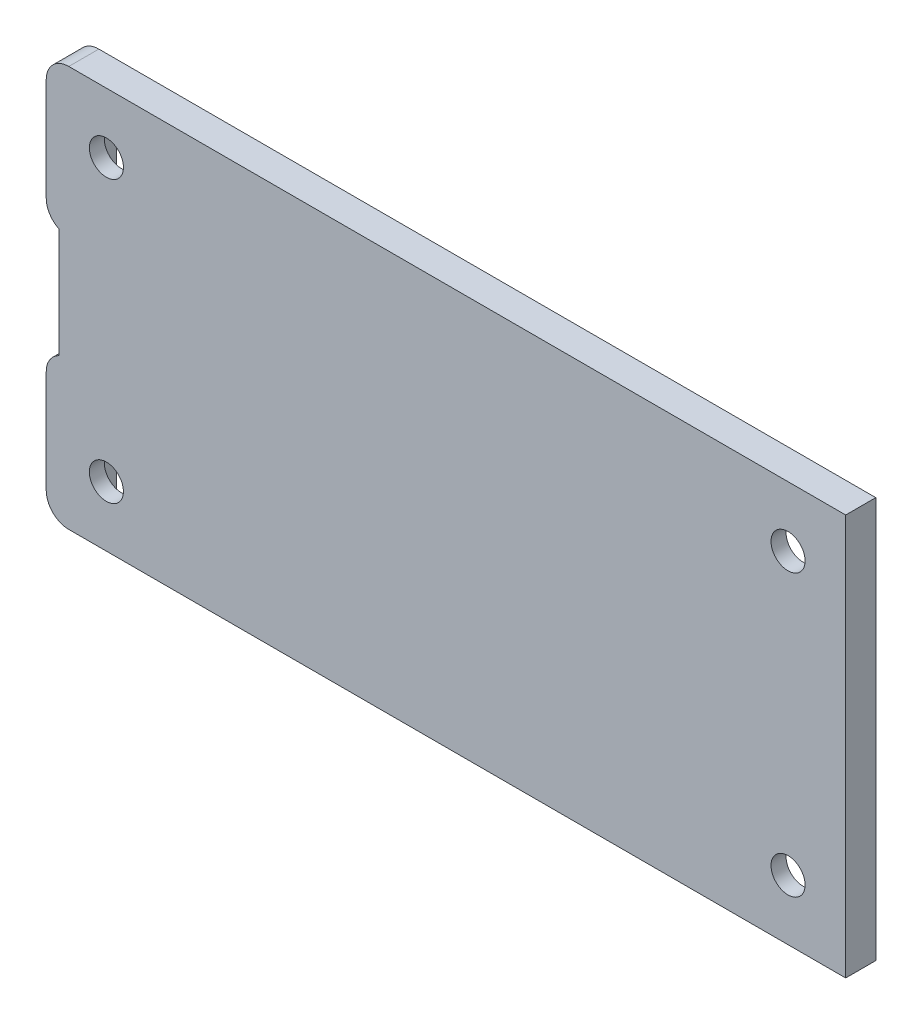
ISO-10303-21;
HEADER;
FILE_DESCRIPTION(('STEP AP214'),'2;1');
FILE_NAME('part.step','',(''),(''),'','','');
FILE_SCHEMA(('AUTOMOTIVE_DESIGN { 1 0 10303 214 1 1 1 1 }'));
ENDSEC;
DATA;
#1=APPLICATION_CONTEXT('core data for automotive mechanical design processes');
#2=APPLICATION_PROTOCOL_DEFINITION('international standard','automotive_design',2000,#1);
#3=PRODUCT_CONTEXT('',#1,'mechanical');
#4=PRODUCT('Part','Part','',(#3));
#5=PRODUCT_RELATED_PRODUCT_CATEGORY('part','',(#4));
#6=PRODUCT_DEFINITION_FORMATION('','',#4);
#7=PRODUCT_DEFINITION_CONTEXT('part definition',#1,'design');
#8=PRODUCT_DEFINITION('design','',#6,#7);
#9=PRODUCT_DEFINITION_SHAPE('','',#8);
#10=(LENGTH_UNIT() NAMED_UNIT(*) SI_UNIT(.MILLI.,.METRE.));
#11=(NAMED_UNIT(*) PLANE_ANGLE_UNIT() SI_UNIT($,.RADIAN.));
#12=(NAMED_UNIT(*) SI_UNIT($,.STERADIAN.) SOLID_ANGLE_UNIT());
#13=UNCERTAINTY_MEASURE_WITH_UNIT(LENGTH_MEASURE(1.E-05),#10,'distance_accuracy_value','');
#14=(GEOMETRIC_REPRESENTATION_CONTEXT(3) GLOBAL_UNCERTAINTY_ASSIGNED_CONTEXT((#13)) GLOBAL_UNIT_ASSIGNED_CONTEXT((#10,
#11,#12)) REPRESENTATION_CONTEXT('',''));
#15=CARTESIAN_POINT('',(0.,0.,0.));
#16=DIRECTION('',(0.,0.,1.));
#17=DIRECTION('',(1.,0.,0.));
#18=AXIS2_PLACEMENT_3D('',#15,#16,#17);
#19=CARTESIAN_POINT('',(0.,0.,3.));
#20=DIRECTION('',(1.,0.,0.));
#21=DIRECTION('',(0.,0.,-1.));
#22=AXIS2_PLACEMENT_3D('',#19,#20,#21);
#23=PLANE('',#22);
#24=DIRECTION('',(0.,-1.,0.));
#25=VECTOR('',#24,1.);
#26=CARTESIAN_POINT('',(0.,0.,3.));
#27=LINE('',#26,#25);
#28=CARTESIAN_POINT('',(0.,37.75,3.));
#29=VERTEX_POINT('',#28);
#30=CARTESIAN_POINT('',(0.,27.5,3.));
#31=VERTEX_POINT('',#30);
#32=EDGE_CURVE('E231',#29,#31,#27,.T.);
#33=ORIENTED_EDGE('',*,*,#32,.F.);
#34=DIRECTION('',(0.,0.,-1.));
#35=VECTOR('',#34,1.);
#36=CARTESIAN_POINT('',(0.,37.75,3.));
#37=LINE('',#36,#35);
#38=CARTESIAN_POINT('',(0.,37.75,0.));
#39=VERTEX_POINT('',#38);
#40=EDGE_CURVE('E286',#29,#39,#37,.T.);
#41=ORIENTED_EDGE('',*,*,#40,.T.);
#42=DIRECTION('',(0.,-1.,0.));
#43=VECTOR('',#42,1.);
#44=CARTESIAN_POINT('',(0.,0.,0.));
#45=LINE('',#44,#43);
#46=CARTESIAN_POINT('',(0.,27.5,0.));
#47=VERTEX_POINT('',#46);
#48=EDGE_CURVE('E241',#39,#47,#45,.T.);
#49=ORIENTED_EDGE('',*,*,#48,.T.);
#50=DIRECTION('',(0.,0.,1.));
#51=VECTOR('',#50,1.);
#52=CARTESIAN_POINT('',(0.,27.5,3.));
#53=LINE('',#52,#51);
#54=EDGE_CURVE('E271',#47,#31,#53,.T.);
#55=ORIENTED_EDGE('',*,*,#54,.T.);
#56=EDGE_LOOP('',(#33,#41,#49,#55));
#57=FACE_BOUND('',#56,.T.);
#58=ADVANCED_FACE('F36',(#57),#23,.F.);
#59=CARTESIAN_POINT('',(0.,12.5,0.));
#60=VERTEX_POINT('',#59);
#61=CARTESIAN_POINT('',(0.,2.25,0.));
#62=VERTEX_POINT('',#61);
#63=EDGE_CURVE('E230',#60,#62,#45,.T.);
#64=ORIENTED_EDGE('',*,*,#63,.T.);
#65=DIRECTION('',(0.,0.,-1.));
#66=VECTOR('',#65,1.);
#67=CARTESIAN_POINT('',(0.,2.25,3.));
#68=LINE('',#67,#66);
#69=CARTESIAN_POINT('',(0.,2.25,3.));
#70=VERTEX_POINT('',#69);
#71=EDGE_CURVE('E281',#62,#70,#68,.F.);
#72=ORIENTED_EDGE('',*,*,#71,.T.);
#73=CARTESIAN_POINT('',(0.,12.5,3.));
#74=VERTEX_POINT('',#73);
#75=EDGE_CURVE('E234',#74,#70,#27,.T.);
#76=ORIENTED_EDGE('',*,*,#75,.F.);
#77=DIRECTION('',(0.,0.,1.));
#78=VECTOR('',#77,1.);
#79=CARTESIAN_POINT('',(0.,12.5,3.));
#80=LINE('',#79,#78);
#81=EDGE_CURVE('E261',#74,#60,#80,.F.);
#82=ORIENTED_EDGE('',*,*,#81,.T.);
#83=EDGE_LOOP('',(#64,#72,#76,#82));
#84=FACE_BOUND('',#83,.T.);
#85=ADVANCED_FACE('F328',(#84),#23,.F.);
#86=CARTESIAN_POINT('',(0.,0.,3.));
#87=DIRECTION('',(0.,1.,0.));
#88=DIRECTION('',(0.,0.,1.));
#89=AXIS2_PLACEMENT_3D('',#86,#87,#88);
#90=PLANE('',#89);
#91=DIRECTION('',(1.,0.,0.));
#92=VECTOR('',#91,1.);
#93=CARTESIAN_POINT('',(0.,0.,3.));
#94=LINE('',#93,#92);
#95=CARTESIAN_POINT('',(2.25,0.,3.));
#96=VERTEX_POINT('',#95);
#97=CARTESIAN_POINT('',(79.75,0.,3.));
#98=VERTEX_POINT('',#97);
#99=EDGE_CURVE('E233',#96,#98,#94,.T.);
#100=ORIENTED_EDGE('',*,*,#99,.F.);
#101=DIRECTION('',(0.,0.,-1.));
#102=VECTOR('',#101,1.);
#103=CARTESIAN_POINT('',(2.25,0.,3.));
#104=LINE('',#103,#102);
#105=CARTESIAN_POINT('',(2.25,0.,0.));
#106=VERTEX_POINT('',#105);
#107=EDGE_CURVE('E274',#96,#106,#104,.T.);
#108=ORIENTED_EDGE('',*,*,#107,.T.);
#109=DIRECTION('',(1.,0.,0.));
#110=VECTOR('',#109,1.);
#111=CARTESIAN_POINT('',(0.,0.,0.));
#112=LINE('',#111,#110);
#113=CARTESIAN_POINT('',(79.75,0.,0.));
#114=VERTEX_POINT('',#113);
#115=EDGE_CURVE('E244',#106,#114,#112,.T.);
#116=ORIENTED_EDGE('',*,*,#115,.T.);
#117=DIRECTION('',(0.,0.,-1.));
#118=VECTOR('',#117,1.);
#119=CARTESIAN_POINT('',(79.75,0.,3.));
#120=LINE('',#119,#118);
#121=EDGE_CURVE('E253',#98,#114,#120,.T.);
#122=ORIENTED_EDGE('',*,*,#121,.F.);
#123=EDGE_LOOP('',(#100,#108,#116,#122));
#124=FACE_BOUND('',#123,.T.);
#125=ADVANCED_FACE('F340',(#124),#90,.F.);
#126=CARTESIAN_POINT('',(79.75,0.,3.));
#127=DIRECTION('',(-1.,0.,0.));
#128=DIRECTION('',(0.,-1.,0.));
#129=AXIS2_PLACEMENT_3D('',#126,#127,#128);
#130=PLANE('',#129);
#131=DIRECTION('',(0.,1.,0.));
#132=VECTOR('',#131,1.);
#133=CARTESIAN_POINT('',(79.75,0.,0.));
#134=LINE('',#133,#132);
#135=CARTESIAN_POINT('',(79.75,40.,0.));
#136=VERTEX_POINT('',#135);
#137=EDGE_CURVE('E246',#114,#136,#134,.T.);
#138=ORIENTED_EDGE('',*,*,#137,.T.);
#139=DIRECTION('',(0.,0.,-1.));
#140=VECTOR('',#139,1.);
#141=CARTESIAN_POINT('',(79.75,40.,3.));
#142=LINE('',#141,#140);
#143=CARTESIAN_POINT('',(79.75,40.,3.));
#144=VERTEX_POINT('',#143);
#145=EDGE_CURVE('E240',#144,#136,#142,.T.);
#146=ORIENTED_EDGE('',*,*,#145,.F.);
#147=DIRECTION('',(0.,1.,0.));
#148=VECTOR('',#147,1.);
#149=CARTESIAN_POINT('',(79.75,0.,3.));
#150=LINE('',#149,#148);
#151=EDGE_CURVE('E236',#98,#144,#150,.T.);
#152=ORIENTED_EDGE('',*,*,#151,.F.);
#153=ORIENTED_EDGE('',*,*,#121,.T.);
#154=EDGE_LOOP('',(#138,#146,#152,#153));
#155=FACE_BOUND('',#154,.T.);
#156=ADVANCED_FACE('F346',(#155),#130,.F.);
#157=CARTESIAN_POINT('',(0.,40.,3.));
#158=DIRECTION('',(0.,-1.,0.));
#159=DIRECTION('',(0.,0.,-1.));
#160=AXIS2_PLACEMENT_3D('',#157,#158,#159);
#161=PLANE('',#160);
#162=DIRECTION('',(-1.,0.,0.));
#163=VECTOR('',#162,1.);
#164=CARTESIAN_POINT('',(0.,40.,0.));
#165=LINE('',#164,#163);
#166=CARTESIAN_POINT('',(2.25,40.,0.));
#167=VERTEX_POINT('',#166);
#168=EDGE_CURVE('E248',#136,#167,#165,.T.);
#169=ORIENTED_EDGE('',*,*,#168,.T.);
#170=DIRECTION('',(0.,0.,-1.));
#171=VECTOR('',#170,1.);
#172=CARTESIAN_POINT('',(2.25,40.,3.));
#173=LINE('',#172,#171);
#174=CARTESIAN_POINT('',(2.25,40.,3.));
#175=VERTEX_POINT('',#174);
#176=EDGE_CURVE('E45',#167,#175,#173,.F.);
#177=ORIENTED_EDGE('',*,*,#176,.T.);
#178=DIRECTION('',(-1.,0.,0.));
#179=VECTOR('',#178,1.);
#180=CARTESIAN_POINT('',(0.,40.,3.));
#181=LINE('',#180,#179);
#182=EDGE_CURVE('E238',#144,#175,#181,.T.);
#183=ORIENTED_EDGE('',*,*,#182,.F.);
#184=ORIENTED_EDGE('',*,*,#145,.T.);
#185=EDGE_LOOP('',(#169,#177,#183,#184));
#186=FACE_BOUND('',#185,.T.);
#187=ADVANCED_FACE('F311',(#186),#161,.F.);
#188=CARTESIAN_POINT('',(0.,0.,3.));
#189=DIRECTION('',(0.,0.,-1.));
#190=DIRECTION('',(-1.,0.,0.));
#191=AXIS2_PLACEMENT_3D('',#188,#189,#190);
#192=PLANE('',#191);
#193=CARTESIAN_POINT('',(74.,34.,3.));
#194=DIRECTION('',(0.,0.,1.));
#195=DIRECTION('',(1.,0.,0.));
#196=AXIS2_PLACEMENT_3D('',#193,#194,#195);
#197=CIRCLE('',#196,1.7);
#198=CARTESIAN_POINT('',(75.7,34.,3.));
#199=VERTEX_POINT('',#198);
#200=EDGE_CURVE('E295',#199,#199,#197,.T.);
#201=ORIENTED_EDGE('',*,*,#200,.F.);
#202=EDGE_LOOP('',(#201));
#203=FACE_BOUND('',#202,.T.);
#204=CARTESIAN_POINT('',(6.,6.00000000000001,3.));
#205=DIRECTION('',(0.,0.,1.));
#206=DIRECTION('',(1.,0.,0.));
#207=AXIS2_PLACEMENT_3D('',#204,#205,#206);
#208=CIRCLE('',#207,1.7);
#209=CARTESIAN_POINT('',(7.7,6.00000000000001,3.));
#210=VERTEX_POINT('',#209);
#211=EDGE_CURVE('E582',#210,#210,#208,.T.);
#212=ORIENTED_EDGE('',*,*,#211,.F.);
#213=EDGE_LOOP('',(#212));
#214=FACE_BOUND('',#213,.T.);
#215=CARTESIAN_POINT('',(74.,6.,3.));
#216=DIRECTION('',(0.,0.,1.));
#217=DIRECTION('',(1.,0.,0.));
#218=AXIS2_PLACEMENT_3D('',#215,#216,#217);
#219=CIRCLE('',#218,1.70000000000001);
#220=CARTESIAN_POINT('',(75.7,6.,3.));
#221=VERTEX_POINT('',#220);
#222=EDGE_CURVE('E585',#221,#221,#219,.T.);
#223=ORIENTED_EDGE('',*,*,#222,.F.);
#224=EDGE_LOOP('',(#223));
#225=FACE_BOUND('',#224,.T.);
#226=CARTESIAN_POINT('',(6.,34.,3.));
#227=DIRECTION('',(0.,0.,1.));
#228=DIRECTION('',(1.,0.,0.));
#229=AXIS2_PLACEMENT_3D('',#226,#227,#228);
#230=CIRCLE('',#229,1.7);
#231=CARTESIAN_POINT('',(7.7,34.,3.));
#232=VERTEX_POINT('',#231);
#233=EDGE_CURVE('E183',#232,#232,#230,.T.);
#234=ORIENTED_EDGE('',*,*,#233,.F.);
#235=EDGE_LOOP('',(#234));
#236=FACE_BOUND('',#235,.T.);
#237=DIRECTION('',(0.,-1.,0.));
#238=VECTOR('',#237,1.);
#239=CARTESIAN_POINT('',(1.25,25.4844355629254,3.));
#240=LINE('',#239,#238);
#241=CARTESIAN_POINT('',(1.25,25.4844355629254,3.));
#242=VERTEX_POINT('',#241);
#243=CARTESIAN_POINT('',(1.25,14.5155644370746,3.));
#244=VERTEX_POINT('',#243);
#245=EDGE_CURVE('E196',#242,#244,#240,.T.);
#246=ORIENTED_EDGE('',*,*,#245,.T.);
#247=CARTESIAN_POINT('',(2.25,12.5,3.));
#248=DIRECTION('',(0.,0.,-1.));
#249=DIRECTION('',(-1.,0.,0.));
#250=AXIS2_PLACEMENT_3D('',#247,#248,#249);
#251=CIRCLE('',#250,2.25);
#252=EDGE_CURVE('E259',#244,#74,#251,.F.);
#253=ORIENTED_EDGE('',*,*,#252,.T.);
#254=ORIENTED_EDGE('',*,*,#75,.T.);
#255=CARTESIAN_POINT('',(2.25,2.25,3.));
#256=DIRECTION('',(0.,0.,-1.));
#257=DIRECTION('',(-1.,0.,0.));
#258=AXIS2_PLACEMENT_3D('',#255,#256,#257);
#259=CIRCLE('',#258,2.25);
#260=EDGE_CURVE('E284',#70,#96,#259,.F.);
#261=ORIENTED_EDGE('',*,*,#260,.T.);
#262=ORIENTED_EDGE('',*,*,#99,.T.);
#263=ORIENTED_EDGE('',*,*,#151,.T.);
#264=ORIENTED_EDGE('',*,*,#182,.T.);
#265=CARTESIAN_POINT('',(2.25,37.75,3.));
#266=DIRECTION('',(0.,0.,-1.));
#267=DIRECTION('',(-1.,0.,0.));
#268=AXIS2_PLACEMENT_3D('',#265,#266,#267);
#269=CIRCLE('',#268,2.25);
#270=EDGE_CURVE('E61',#175,#29,#269,.F.);
#271=ORIENTED_EDGE('',*,*,#270,.T.);
#272=ORIENTED_EDGE('',*,*,#32,.T.);
#273=CARTESIAN_POINT('',(2.25,27.5,3.));
#274=DIRECTION('',(0.,0.,-1.));
#275=DIRECTION('',(-1.,0.,0.));
#276=AXIS2_PLACEMENT_3D('',#273,#274,#275);
#277=CIRCLE('',#276,2.25);
#278=EDGE_CURVE('E256',#31,#242,#277,.F.);
#279=ORIENTED_EDGE('',*,*,#278,.T.);
#280=EDGE_LOOP('',(#246,#253,#254,#261,#262,#263,#264,#271,#272,#279));
#281=FACE_BOUND('',#280,.T.);
#282=ADVANCED_FACE('F308',(#203,#214,#225,#236,#281),#192,.F.);
#283=CARTESIAN_POINT('',(0.,0.,0.));
#284=DIRECTION('',(0.,0.,-1.));
#285=DIRECTION('',(-1.,0.,0.));
#286=AXIS2_PLACEMENT_3D('',#283,#284,#285);
#287=PLANE('',#286);
#288=DIRECTION('',(0.,1.,0.));
#289=VECTOR('',#288,1.);
#290=CARTESIAN_POINT('',(4.,37.75,0.));
#291=LINE('',#290,#289);
#292=CARTESIAN_POINT('',(4.,2.25,0.));
#293=VERTEX_POINT('',#292);
#294=CARTESIAN_POINT('',(4.,37.75,0.));
#295=VERTEX_POINT('',#294);
#296=EDGE_CURVE('E53',#293,#295,#291,.T.);
#297=ORIENTED_EDGE('',*,*,#296,.F.);
#298=DIRECTION('',(-1.,0.,0.));
#299=VECTOR('',#298,1.);
#300=CARTESIAN_POINT('',(4.,2.25,0.));
#301=LINE('',#300,#299);
#302=CARTESIAN_POINT('',(77.5,2.25,0.));
#303=VERTEX_POINT('',#302);
#304=EDGE_CURVE('E177',#303,#293,#301,.T.);
#305=ORIENTED_EDGE('',*,*,#304,.F.);
#306=DIRECTION('',(0.,-1.,0.));
#307=VECTOR('',#306,1.);
#308=CARTESIAN_POINT('',(77.5,37.75,0.));
#309=LINE('',#308,#307);
#310=CARTESIAN_POINT('',(77.5,37.75,0.));
#311=VERTEX_POINT('',#310);
#312=EDGE_CURVE('E180',#311,#303,#309,.T.);
#313=ORIENTED_EDGE('',*,*,#312,.F.);
#314=DIRECTION('',(1.,0.,0.));
#315=VECTOR('',#314,1.);
#316=CARTESIAN_POINT('',(4.,37.75,0.));
#317=LINE('',#316,#315);
#318=EDGE_CURVE('E189',#295,#311,#317,.T.);
#319=ORIENTED_EDGE('',*,*,#318,.F.);
#320=EDGE_LOOP('',(#297,#305,#313,#319));
#321=FACE_BOUND('',#320,.T.);
#322=ORIENTED_EDGE('',*,*,#115,.F.);
#323=CARTESIAN_POINT('',(2.25,2.25,0.));
#324=DIRECTION('',(0.,0.,-1.));
#325=DIRECTION('',(-1.,0.,0.));
#326=AXIS2_PLACEMENT_3D('',#323,#324,#325);
#327=CIRCLE('',#326,2.25);
#328=EDGE_CURVE('E279',#106,#62,#327,.T.);
#329=ORIENTED_EDGE('',*,*,#328,.T.);
#330=ORIENTED_EDGE('',*,*,#63,.F.);
#331=CARTESIAN_POINT('',(2.25,12.5,0.));
#332=DIRECTION('',(0.,0.,-1.));
#333=DIRECTION('',(-1.,0.,0.));
#334=AXIS2_PLACEMENT_3D('',#331,#332,#333);
#335=CIRCLE('',#334,2.25);
#336=CARTESIAN_POINT('',(1.25,14.5155644370746,0.));
#337=VERTEX_POINT('',#336);
#338=EDGE_CURVE('E268',#60,#337,#335,.T.);
#339=ORIENTED_EDGE('',*,*,#338,.T.);
#340=CARTESIAN_POINT('',(2.25,14.75,0.));
#341=VERTEX_POINT('',#340);
#342=EDGE_CURVE('E267',#337,#341,#335,.T.);
#343=ORIENTED_EDGE('',*,*,#342,.T.);
#344=DIRECTION('',(0.,1.,0.));
#345=VECTOR('',#344,1.);
#346=CARTESIAN_POINT('',(2.25,25.25,0.));
#347=LINE('',#346,#345);
#348=CARTESIAN_POINT('',(2.25,25.25,0.));
#349=VERTEX_POINT('',#348);
#350=EDGE_CURVE('E218',#341,#349,#347,.T.);
#351=ORIENTED_EDGE('',*,*,#350,.T.);
#352=CARTESIAN_POINT('',(2.25,27.5,0.));
#353=DIRECTION('',(0.,0.,-1.));
#354=DIRECTION('',(-1.,0.,0.));
#355=AXIS2_PLACEMENT_3D('',#352,#353,#354);
#356=CIRCLE('',#355,2.25);
#357=CARTESIAN_POINT('',(1.25,25.4844355629254,0.));
#358=VERTEX_POINT('',#357);
#359=EDGE_CURVE('E264',#349,#358,#356,.T.);
#360=ORIENTED_EDGE('',*,*,#359,.T.);
#361=EDGE_CURVE('E263',#358,#47,#356,.T.);
#362=ORIENTED_EDGE('',*,*,#361,.T.);
#363=ORIENTED_EDGE('',*,*,#48,.F.);
#364=CARTESIAN_POINT('',(2.25,37.75,0.));
#365=DIRECTION('',(0.,0.,-1.));
#366=DIRECTION('',(-1.,0.,0.));
#367=AXIS2_PLACEMENT_3D('',#364,#365,#366);
#368=CIRCLE('',#367,2.25);
#369=EDGE_CURVE('E277',#39,#167,#368,.T.);
#370=ORIENTED_EDGE('',*,*,#369,.T.);
#371=ORIENTED_EDGE('',*,*,#168,.F.);
#372=ORIENTED_EDGE('',*,*,#137,.F.);
#373=EDGE_LOOP('',(#322,#329,#330,#339,#343,#351,#360,#362,#363,#370,#371,#372));
#374=FACE_BOUND('',#373,.T.);
#375=ADVANCED_FACE('F310',(#321,#374),#287,.T.);
#376=CARTESIAN_POINT('',(2.25,12.5,0.));
#377=DIRECTION('',(0.,0.,1.));
#378=DIRECTION('',(1.,0.,0.));
#379=AXIS2_PLACEMENT_3D('',#376,#377,#378);
#380=CYLINDRICAL_SURFACE('',#379,2.25);
#381=DIRECTION('',(0.,0.,1.));
#382=VECTOR('',#381,1.);
#383=CARTESIAN_POINT('',(1.25,14.5155644370746,-0.7));
#384=LINE('',#383,#382);
#385=EDGE_CURVE('E225',#337,#244,#384,.T.);
#386=ORIENTED_EDGE('',*,*,#385,.F.);
#387=ORIENTED_EDGE('',*,*,#338,.F.);
#388=ORIENTED_EDGE('',*,*,#81,.F.);
#389=ORIENTED_EDGE('',*,*,#252,.F.);
#390=EDGE_LOOP('',(#386,#387,#388,#389));
#391=FACE_BOUND('',#390,.T.);
#392=ADVANCED_FACE('F323',(#391),#380,.T.);
#393=CARTESIAN_POINT('',(2.25,27.5,3.));
#394=DIRECTION('',(0.,0.,1.));
#395=DIRECTION('',(1.,0.,0.));
#396=AXIS2_PLACEMENT_3D('',#393,#394,#395);
#397=CYLINDRICAL_SURFACE('',#396,2.25);
#398=DIRECTION('',(0.,0.,1.));
#399=VECTOR('',#398,1.);
#400=CARTESIAN_POINT('',(1.25,25.4844355629254,3.));
#401=LINE('',#400,#399);
#402=EDGE_CURVE('E11',#242,#358,#401,.F.);
#403=ORIENTED_EDGE('',*,*,#402,.F.);
#404=ORIENTED_EDGE('',*,*,#278,.F.);
#405=ORIENTED_EDGE('',*,*,#54,.F.);
#406=ORIENTED_EDGE('',*,*,#361,.F.);
#407=EDGE_LOOP('',(#403,#404,#405,#406));
#408=FACE_BOUND('',#407,.T.);
#409=ADVANCED_FACE('F357',(#408),#397,.T.);
#410=CARTESIAN_POINT('',(2.25,2.25,3.));
#411=DIRECTION('',(0.,0.,-1.));
#412=DIRECTION('',(-1.,0.,0.));
#413=AXIS2_PLACEMENT_3D('',#410,#411,#412);
#414=CYLINDRICAL_SURFACE('',#413,2.25);
#415=ORIENTED_EDGE('',*,*,#260,.F.);
#416=ORIENTED_EDGE('',*,*,#71,.F.);
#417=ORIENTED_EDGE('',*,*,#328,.F.);
#418=ORIENTED_EDGE('',*,*,#107,.F.);
#419=EDGE_LOOP('',(#415,#416,#417,#418));
#420=FACE_BOUND('',#419,.T.);
#421=ADVANCED_FACE('F337',(#420),#414,.T.);
#422=CARTESIAN_POINT('',(2.25,37.75,3.));
#423=DIRECTION('',(0.,0.,-1.));
#424=DIRECTION('',(-1.,0.,0.));
#425=AXIS2_PLACEMENT_3D('',#422,#423,#424);
#426=CYLINDRICAL_SURFACE('',#425,2.25);
#427=ORIENTED_EDGE('',*,*,#270,.F.);
#428=ORIENTED_EDGE('',*,*,#176,.F.);
#429=ORIENTED_EDGE('',*,*,#369,.F.);
#430=ORIENTED_EDGE('',*,*,#40,.F.);
#431=EDGE_LOOP('',(#427,#428,#429,#430));
#432=FACE_BOUND('',#431,.T.);
#433=ADVANCED_FACE('F38',(#432),#426,.T.);
#434=CARTESIAN_POINT('',(2.25000000000001,27.5,-0.7));
#435=DIRECTION('',(0.,0.,1.));
#436=DIRECTION('',(1.,0.,0.));
#437=AXIS2_PLACEMENT_3D('',#434,#435,#436);
#438=CYLINDRICAL_SURFACE('',#437,2.25000000000004);
#439=DIRECTION('',(0.,0.,1.));
#440=VECTOR('',#439,1.);
#441=CARTESIAN_POINT('',(1.25,25.4844355629254,-0.7));
#442=LINE('',#441,#440);
#443=CARTESIAN_POINT('',(1.25,25.4844355629254,-0.7));
#444=VERTEX_POINT('',#443);
#445=EDGE_CURVE('E212',#444,#358,#442,.T.);
#446=ORIENTED_EDGE('',*,*,#445,.T.);
#447=ORIENTED_EDGE('',*,*,#359,.F.);
#448=DIRECTION('',(0.,0.,1.));
#449=VECTOR('',#448,1.);
#450=CARTESIAN_POINT('',(2.25,25.25,-0.7));
#451=LINE('',#450,#449);
#452=CARTESIAN_POINT('',(2.25,25.25,-0.7));
#453=VERTEX_POINT('',#452);
#454=EDGE_CURVE('E215',#453,#349,#451,.T.);
#455=ORIENTED_EDGE('',*,*,#454,.F.);
#456=CARTESIAN_POINT('',(2.25000000000001,27.5,-0.7));
#457=DIRECTION('',(0.,0.,-1.));
#458=DIRECTION('',(1.,0.,0.));
#459=AXIS2_PLACEMENT_3D('',#456,#457,#458);
#460=CIRCLE('',#459,2.25000000000004);
#461=EDGE_CURVE('E200',#453,#444,#460,.T.);
#462=ORIENTED_EDGE('',*,*,#461,.T.);
#463=EDGE_LOOP('',(#446,#447,#455,#462));
#464=FACE_BOUND('',#463,.T.);
#465=ADVANCED_FACE('F361',(#464),#438,.F.);
#466=CARTESIAN_POINT('',(2.25,25.25,-0.7));
#467=DIRECTION('',(1.,0.,0.));
#468=DIRECTION('',(0.,0.,-1.));
#469=AXIS2_PLACEMENT_3D('',#466,#467,#468);
#470=PLANE('',#469);
#471=ORIENTED_EDGE('',*,*,#454,.T.);
#472=ORIENTED_EDGE('',*,*,#350,.F.);
#473=DIRECTION('',(0.,0.,1.));
#474=VECTOR('',#473,1.);
#475=CARTESIAN_POINT('',(2.25,14.75,-0.7));
#476=LINE('',#475,#474);
#477=CARTESIAN_POINT('',(2.25,14.75,-0.7));
#478=VERTEX_POINT('',#477);
#479=EDGE_CURVE('E219',#478,#341,#476,.T.);
#480=ORIENTED_EDGE('',*,*,#479,.F.);
#481=DIRECTION('',(0.,1.,0.));
#482=VECTOR('',#481,1.);
#483=CARTESIAN_POINT('',(2.25,25.25,-0.7));
#484=LINE('',#483,#482);
#485=EDGE_CURVE('E209',#478,#453,#484,.T.);
#486=ORIENTED_EDGE('',*,*,#485,.T.);
#487=EDGE_LOOP('',(#471,#472,#480,#486));
#488=FACE_BOUND('',#487,.T.);
#489=ADVANCED_FACE('F368',(#488),#470,.T.);
#490=CARTESIAN_POINT('',(2.25000000000001,12.5,-0.7));
#491=DIRECTION('',(0.,0.,1.));
#492=DIRECTION('',(1.,0.,0.));
#493=AXIS2_PLACEMENT_3D('',#490,#491,#492);
#494=CYLINDRICAL_SURFACE('',#493,2.25000000000003);
#495=ORIENTED_EDGE('',*,*,#479,.T.);
#496=ORIENTED_EDGE('',*,*,#342,.F.);
#497=CARTESIAN_POINT('',(1.25,14.5155644370746,-0.7));
#498=VERTEX_POINT('',#497);
#499=EDGE_CURVE('E222',#498,#337,#384,.T.);
#500=ORIENTED_EDGE('',*,*,#499,.F.);
#501=CARTESIAN_POINT('',(2.25000000000001,12.5,-0.7));
#502=DIRECTION('',(0.,0.,-1.));
#503=DIRECTION('',(-1.,0.,0.));
#504=AXIS2_PLACEMENT_3D('',#501,#502,#503);
#505=CIRCLE('',#504,2.25000000000003);
#506=EDGE_CURVE('E206',#498,#478,#505,.T.);
#507=ORIENTED_EDGE('',*,*,#506,.T.);
#508=EDGE_LOOP('',(#495,#496,#500,#507));
#509=FACE_BOUND('',#508,.T.);
#510=ADVANCED_FACE('F370',(#509),#494,.F.);
#511=CARTESIAN_POINT('',(1.25,25.4844355629254,-0.7));
#512=DIRECTION('',(-1.,0.,0.));
#513=DIRECTION('',(0.,-1.,0.));
#514=AXIS2_PLACEMENT_3D('',#511,#512,#513);
#515=PLANE('',#514);
#516=ORIENTED_EDGE('',*,*,#245,.F.);
#517=ORIENTED_EDGE('',*,*,#402,.T.);
#518=ORIENTED_EDGE('',*,*,#445,.F.);
#519=DIRECTION('',(0.,-1.,0.));
#520=VECTOR('',#519,1.);
#521=CARTESIAN_POINT('',(1.25,25.4844355629254,-0.7));
#522=LINE('',#521,#520);
#523=EDGE_CURVE('E203',#444,#498,#522,.T.);
#524=ORIENTED_EDGE('',*,*,#523,.T.);
#525=ORIENTED_EDGE('',*,*,#499,.T.);
#526=ORIENTED_EDGE('',*,*,#385,.T.);
#527=EDGE_LOOP('',(#516,#517,#518,#524,#525,#526));
#528=FACE_BOUND('',#527,.T.);
#529=ADVANCED_FACE('F358',(#528),#515,.T.);
#530=CARTESIAN_POINT('',(2.25000000000001,27.5,-0.7));
#531=DIRECTION('',(0.,0.,1.));
#532=DIRECTION('',(1.,0.,0.));
#533=AXIS2_PLACEMENT_3D('',#530,#531,#532);
#534=PLANE('',#533);
#535=ORIENTED_EDGE('',*,*,#461,.F.);
#536=ORIENTED_EDGE('',*,*,#485,.F.);
#537=ORIENTED_EDGE('',*,*,#506,.F.);
#538=ORIENTED_EDGE('',*,*,#523,.F.);
#539=EDGE_LOOP('',(#535,#536,#537,#538));
#540=FACE_BOUND('',#539,.T.);
#541=ADVANCED_FACE('F365',(#540),#534,.F.);
#542=CARTESIAN_POINT('',(4.,37.75,1.5));
#543=DIRECTION('',(-1.,0.,0.));
#544=DIRECTION('',(0.,-1.,0.));
#545=AXIS2_PLACEMENT_3D('',#542,#543,#544);
#546=PLANE('',#545);
#547=ORIENTED_EDGE('',*,*,#296,.T.);
#548=DIRECTION('',(0.,0.,-1.));
#549=VECTOR('',#548,1.);
#550=CARTESIAN_POINT('',(4.,37.75,1.5));
#551=LINE('',#550,#549);
#552=CARTESIAN_POINT('',(4.,37.75,1.5));
#553=VERTEX_POINT('',#552);
#554=EDGE_CURVE('E155',#553,#295,#551,.T.);
#555=ORIENTED_EDGE('',*,*,#554,.F.);
#556=DIRECTION('',(0.,1.,0.));
#557=VECTOR('',#556,1.);
#558=CARTESIAN_POINT('',(4.,37.75,1.5));
#559=LINE('',#558,#557);
#560=CARTESIAN_POINT('',(4.,2.25,1.5));
#561=VERTEX_POINT('',#560);
#562=EDGE_CURVE('E159',#561,#553,#559,.T.);
#563=ORIENTED_EDGE('',*,*,#562,.F.);
#564=DIRECTION('',(0.,0.,-1.));
#565=VECTOR('',#564,1.);
#566=CARTESIAN_POINT('',(4.,2.25,1.5));
#567=LINE('',#566,#565);
#568=EDGE_CURVE('E194',#561,#293,#567,.T.);
#569=ORIENTED_EDGE('',*,*,#568,.T.);
#570=EDGE_LOOP('',(#547,#555,#563,#569));
#571=FACE_BOUND('',#570,.T.);
#572=ADVANCED_FACE('F157',(#571),#546,.F.);
#573=CARTESIAN_POINT('',(4.,2.25,1.5));
#574=DIRECTION('',(0.,-1.,0.));
#575=DIRECTION('',(1.,0.,0.));
#576=AXIS2_PLACEMENT_3D('',#573,#574,#575);
#577=PLANE('',#576);
#578=ORIENTED_EDGE('',*,*,#304,.T.);
#579=ORIENTED_EDGE('',*,*,#568,.F.);
#580=DIRECTION('',(-1.,0.,0.));
#581=VECTOR('',#580,1.);
#582=CARTESIAN_POINT('',(4.,2.25,1.5));
#583=LINE('',#582,#581);
#584=CARTESIAN_POINT('',(77.5,2.25,1.5));
#585=VERTEX_POINT('',#584);
#586=EDGE_CURVE('E165',#585,#561,#583,.T.);
#587=ORIENTED_EDGE('',*,*,#586,.F.);
#588=DIRECTION('',(0.,0.,-1.));
#589=VECTOR('',#588,1.);
#590=CARTESIAN_POINT('',(77.5,2.25,1.5));
#591=LINE('',#590,#589);
#592=EDGE_CURVE('E197',#585,#303,#591,.T.);
#593=ORIENTED_EDGE('',*,*,#592,.T.);
#594=EDGE_LOOP('',(#578,#579,#587,#593));
#595=FACE_BOUND('',#594,.T.);
#596=ADVANCED_FACE('F460',(#595),#577,.F.);
#597=CARTESIAN_POINT('',(77.5,37.75,1.5));
#598=DIRECTION('',(1.,0.,0.));
#599=DIRECTION('',(0.,0.,-1.));
#600=AXIS2_PLACEMENT_3D('',#597,#598,#599);
#601=PLANE('',#600);
#602=ORIENTED_EDGE('',*,*,#312,.T.);
#603=ORIENTED_EDGE('',*,*,#592,.F.);
#604=DIRECTION('',(0.,-1.,0.));
#605=VECTOR('',#604,1.);
#606=CARTESIAN_POINT('',(77.5,37.75,1.5));
#607=LINE('',#606,#605);
#608=CARTESIAN_POINT('',(77.5,37.75,1.5));
#609=VERTEX_POINT('',#608);
#610=EDGE_CURVE('E173',#609,#585,#607,.T.);
#611=ORIENTED_EDGE('',*,*,#610,.F.);
#612=DIRECTION('',(0.,0.,-1.));
#613=VECTOR('',#612,1.);
#614=CARTESIAN_POINT('',(77.5,37.75,1.5));
#615=LINE('',#614,#613);
#616=EDGE_CURVE('E164',#609,#311,#615,.T.);
#617=ORIENTED_EDGE('',*,*,#616,.T.);
#618=EDGE_LOOP('',(#602,#603,#611,#617));
#619=FACE_BOUND('',#618,.T.);
#620=ADVANCED_FACE('F469',(#619),#601,.F.);
#621=CARTESIAN_POINT('',(4.,37.75,1.5));
#622=DIRECTION('',(0.,1.,0.));
#623=DIRECTION('',(-1.,0.,0.));
#624=AXIS2_PLACEMENT_3D('',#621,#622,#623);
#625=PLANE('',#624);
#626=ORIENTED_EDGE('',*,*,#318,.T.);
#627=ORIENTED_EDGE('',*,*,#616,.F.);
#628=DIRECTION('',(1.,0.,0.));
#629=VECTOR('',#628,1.);
#630=CARTESIAN_POINT('',(4.,37.75,1.5));
#631=LINE('',#630,#629);
#632=EDGE_CURVE('E168',#553,#609,#631,.T.);
#633=ORIENTED_EDGE('',*,*,#632,.F.);
#634=ORIENTED_EDGE('',*,*,#554,.T.);
#635=EDGE_LOOP('',(#626,#627,#633,#634));
#636=FACE_BOUND('',#635,.T.);
#637=ADVANCED_FACE('F169',(#636),#625,.F.);
#638=CARTESIAN_POINT('',(0.,0.,1.5));
#639=DIRECTION('',(0.,0.,1.));
#640=DIRECTION('',(1.,0.,0.));
#641=AXIS2_PLACEMENT_3D('',#638,#639,#640);
#642=PLANE('',#641);
#643=CARTESIAN_POINT('',(74.,34.,1.5));
#644=DIRECTION('',(0.,0.,1.));
#645=DIRECTION('',(1.,0.,0.));
#646=AXIS2_PLACEMENT_3D('',#643,#644,#645);
#647=CIRCLE('',#646,1.7);
#648=CARTESIAN_POINT('',(75.7,34.,1.5));
#649=VERTEX_POINT('',#648);
#650=EDGE_CURVE('E40',#649,#649,#647,.T.);
#651=ORIENTED_EDGE('',*,*,#650,.T.);
#652=EDGE_LOOP('',(#651));
#653=FACE_BOUND('',#652,.T.);
#654=CARTESIAN_POINT('',(6.,6.00000000000001,1.5));
#655=DIRECTION('',(0.,0.,1.));
#656=DIRECTION('',(1.,0.,0.));
#657=AXIS2_PLACEMENT_3D('',#654,#655,#656);
#658=CIRCLE('',#657,1.7);
#659=CARTESIAN_POINT('',(7.7,6.00000000000001,1.5));
#660=VERTEX_POINT('',#659);
#661=EDGE_CURVE('E294',#660,#660,#658,.T.);
#662=ORIENTED_EDGE('',*,*,#661,.T.);
#663=EDGE_LOOP('',(#662));
#664=FACE_BOUND('',#663,.T.);
#665=CARTESIAN_POINT('',(74.,6.,1.5));
#666=DIRECTION('',(0.,0.,1.));
#667=DIRECTION('',(1.,0.,0.));
#668=AXIS2_PLACEMENT_3D('',#665,#666,#667);
#669=CIRCLE('',#668,1.70000000000001);
#670=CARTESIAN_POINT('',(75.7,6.,1.5));
#671=VERTEX_POINT('',#670);
#672=EDGE_CURVE('E292',#671,#671,#669,.T.);
#673=ORIENTED_EDGE('',*,*,#672,.T.);
#674=EDGE_LOOP('',(#673));
#675=FACE_BOUND('',#674,.T.);
#676=CARTESIAN_POINT('',(6.,34.,1.5));
#677=DIRECTION('',(0.,0.,1.));
#678=DIRECTION('',(1.,0.,0.));
#679=AXIS2_PLACEMENT_3D('',#676,#677,#678);
#680=CIRCLE('',#679,1.7);
#681=CARTESIAN_POINT('',(7.7,34.,1.5));
#682=VERTEX_POINT('',#681);
#683=EDGE_CURVE('E190',#682,#682,#680,.T.);
#684=ORIENTED_EDGE('',*,*,#683,.T.);
#685=EDGE_LOOP('',(#684));
#686=FACE_BOUND('',#685,.T.);
#687=ORIENTED_EDGE('',*,*,#562,.T.);
#688=ORIENTED_EDGE('',*,*,#632,.T.);
#689=ORIENTED_EDGE('',*,*,#610,.T.);
#690=ORIENTED_EDGE('',*,*,#586,.T.);
#691=EDGE_LOOP('',(#687,#688,#689,#690));
#692=FACE_BOUND('',#691,.T.);
#693=ADVANCED_FACE('F175',(#653,#664,#675,#686,#692),#642,.F.);
#694=CARTESIAN_POINT('',(6.,34.,-0.7));
#695=DIRECTION('',(0.,0.,1.));
#696=DIRECTION('',(1.,0.,0.));
#697=AXIS2_PLACEMENT_3D('',#694,#695,#696);
#698=CYLINDRICAL_SURFACE('',#697,1.7);
#699=ORIENTED_EDGE('',*,*,#233,.T.);
#700=EDGE_LOOP('',(#699));
#701=FACE_BOUND('',#700,.T.);
#702=ORIENTED_EDGE('',*,*,#683,.F.);
#703=EDGE_LOOP('',(#702));
#704=FACE_BOUND('',#703,.T.);
#705=ADVANCED_FACE('F305',(#701,#704),#698,.F.);
#706=CARTESIAN_POINT('',(74.,6.,-0.7));
#707=DIRECTION('',(0.,0.,1.));
#708=DIRECTION('',(1.,0.,0.));
#709=AXIS2_PLACEMENT_3D('',#706,#707,#708);
#710=CYLINDRICAL_SURFACE('',#709,1.70000000000001);
#711=ORIENTED_EDGE('',*,*,#222,.T.);
#712=EDGE_LOOP('',(#711));
#713=FACE_BOUND('',#712,.T.);
#714=ORIENTED_EDGE('',*,*,#672,.F.);
#715=EDGE_LOOP('',(#714));
#716=FACE_BOUND('',#715,.T.);
#717=ADVANCED_FACE('F506',(#713,#716),#710,.F.);
#718=CARTESIAN_POINT('',(6.,6.00000000000001,-0.7));
#719=DIRECTION('',(0.,0.,1.));
#720=DIRECTION('',(1.,0.,0.));
#721=AXIS2_PLACEMENT_3D('',#718,#719,#720);
#722=CYLINDRICAL_SURFACE('',#721,1.7);
#723=ORIENTED_EDGE('',*,*,#211,.T.);
#724=EDGE_LOOP('',(#723));
#725=FACE_BOUND('',#724,.T.);
#726=ORIENTED_EDGE('',*,*,#661,.F.);
#727=EDGE_LOOP('',(#726));
#728=FACE_BOUND('',#727,.T.);
#729=ADVANCED_FACE('F515',(#725,#728),#722,.F.);
#730=CARTESIAN_POINT('',(74.,34.,-0.7));
#731=DIRECTION('',(0.,0.,1.));
#732=DIRECTION('',(1.,0.,0.));
#733=AXIS2_PLACEMENT_3D('',#730,#731,#732);
#734=CYLINDRICAL_SURFACE('',#733,1.7);
#735=ORIENTED_EDGE('',*,*,#200,.T.);
#736=EDGE_LOOP('',(#735));
#737=FACE_BOUND('',#736,.T.);
#738=ORIENTED_EDGE('',*,*,#650,.F.);
#739=EDGE_LOOP('',(#738));
#740=FACE_BOUND('',#739,.T.);
#741=ADVANCED_FACE('F525',(#737,#740),#734,.F.);
#742=CLOSED_SHELL('',(#58,#85,#125,#156,#187,#282,#375,#392,#409,#421,#433,#465,#489,#510,#529,
#541,#572,#596,#620,#637,#693,#705,#717,#729,#741));
#743=MANIFOLD_SOLID_BREP('B2',#742);
#744=ADVANCED_BREP_SHAPE_REPRESENTATION('',(#18,#743),#14);
#745=SHAPE_DEFINITION_REPRESENTATION(#9,#744);
ENDSEC;
END-ISO-10303-21;
